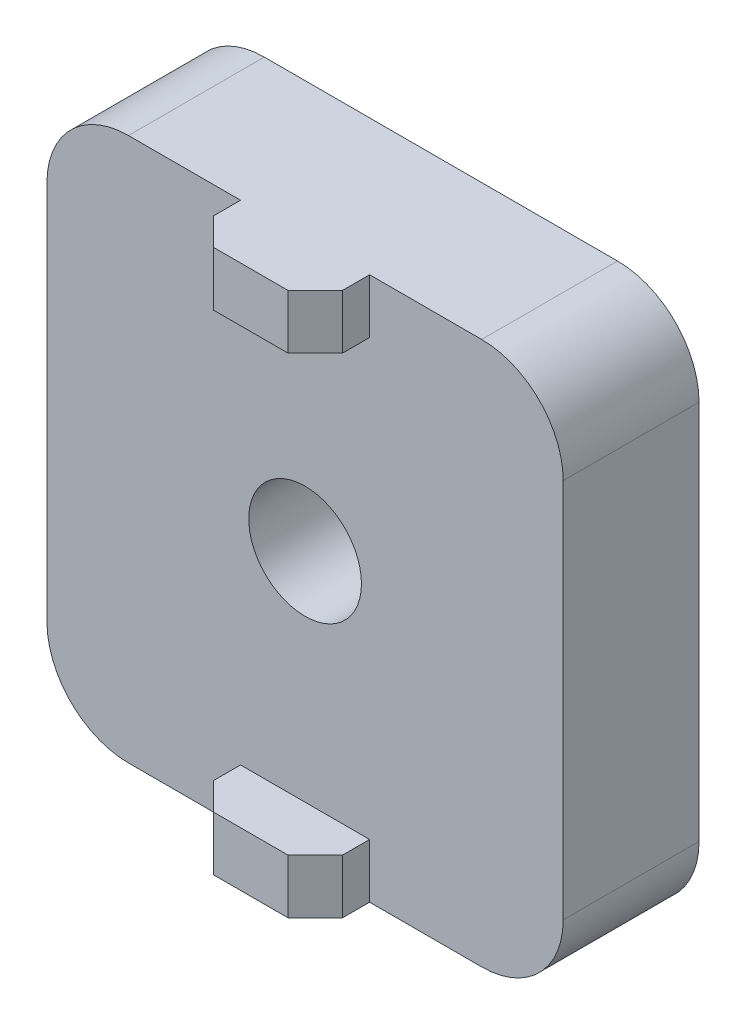
ISO-10303-21;
HEADER;
FILE_DESCRIPTION(('STEP AP214'),'2;1');
FILE_NAME('part.step','',(''),(''),'','','');
FILE_SCHEMA(('AUTOMOTIVE_DESIGN { 1 0 10303 214 1 1 1 1 }'));
ENDSEC;
DATA;
#1=APPLICATION_CONTEXT('core data for automotive mechanical design processes');
#2=APPLICATION_PROTOCOL_DEFINITION('international standard','automotive_design',2000,#1);
#3=PRODUCT_CONTEXT('',#1,'mechanical');
#4=PRODUCT('Part','Part','',(#3));
#5=PRODUCT_RELATED_PRODUCT_CATEGORY('part','',(#4));
#6=PRODUCT_DEFINITION_FORMATION('','',#4);
#7=PRODUCT_DEFINITION_CONTEXT('part definition',#1,'design');
#8=PRODUCT_DEFINITION('design','',#6,#7);
#9=PRODUCT_DEFINITION_SHAPE('','',#8);
#10=(LENGTH_UNIT() NAMED_UNIT(*) SI_UNIT(.MILLI.,.METRE.));
#11=(NAMED_UNIT(*) PLANE_ANGLE_UNIT() SI_UNIT($,.RADIAN.));
#12=(NAMED_UNIT(*) SI_UNIT($,.STERADIAN.) SOLID_ANGLE_UNIT());
#13=UNCERTAINTY_MEASURE_WITH_UNIT(LENGTH_MEASURE(1.E-05),#10,'distance_accuracy_value','');
#14=(GEOMETRIC_REPRESENTATION_CONTEXT(3) GLOBAL_UNCERTAINTY_ASSIGNED_CONTEXT((#13)) GLOBAL_UNIT_ASSIGNED_CONTEXT((#10,
#11,#12)) REPRESENTATION_CONTEXT('',''));
#15=CARTESIAN_POINT('',(0.,0.,0.));
#16=DIRECTION('',(0.,0.,1.));
#17=DIRECTION('',(1.,0.,0.));
#18=AXIS2_PLACEMENT_3D('',#15,#16,#17);
#19=CARTESIAN_POINT('',(0.,0.,5.));
#20=DIRECTION('',(0.,0.,-1.));
#21=DIRECTION('',(-1.,0.,0.));
#22=AXIS2_PLACEMENT_3D('',#19,#20,#21);
#23=PLANE('',#22);
#24=CARTESIAN_POINT('',(0.,0.,5.));
#25=DIRECTION('',(0.,0.,1.));
#26=DIRECTION('',(1.,0.,0.));
#27=AXIS2_PLACEMENT_3D('',#24,#25,#26);
#28=CIRCLE('',#27,4.15);
#29=CARTESIAN_POINT('',(4.15,0.,5.));
#30=VERTEX_POINT('',#29);
#31=EDGE_CURVE('E267',#30,#30,#28,.T.);
#32=ORIENTED_EDGE('',*,*,#31,.F.);
#33=EDGE_LOOP('',(#32));
#34=FACE_BOUND('',#33,.T.);
#35=DIRECTION('',(0.,-1.,0.));
#36=VECTOR('',#35,1.);
#37=CARTESIAN_POINT('',(-4.75,-16.,5.));
#38=LINE('',#37,#36);
#39=CARTESIAN_POINT('',(-4.75,-16.,5.));
#40=VERTEX_POINT('',#39);
#41=CARTESIAN_POINT('',(-4.75,-20.,5.));
#42=VERTEX_POINT('',#41);
#43=EDGE_CURVE('E214',#40,#42,#38,.T.);
#44=ORIENTED_EDGE('',*,*,#43,.F.);
#45=DIRECTION('',(-1.,0.,0.));
#46=VECTOR('',#45,1.);
#47=CARTESIAN_POINT('',(-4.75,-16.,5.));
#48=LINE('',#47,#46);
#49=CARTESIAN_POINT('',(4.75,-16.,5.));
#50=VERTEX_POINT('',#49);
#51=EDGE_CURVE('E211',#50,#40,#48,.T.);
#52=ORIENTED_EDGE('',*,*,#51,.F.);
#53=DIRECTION('',(0.,1.,0.));
#54=VECTOR('',#53,1.);
#55=CARTESIAN_POINT('',(4.75,-16.,5.));
#56=LINE('',#55,#54);
#57=CARTESIAN_POINT('',(4.75,-20.,5.));
#58=VERTEX_POINT('',#57);
#59=EDGE_CURVE('E186',#58,#50,#56,.T.);
#60=ORIENTED_EDGE('',*,*,#59,.F.);
#61=DIRECTION('',(1.,0.,0.));
#62=VECTOR('',#61,1.);
#63=CARTESIAN_POINT('',(-19.,-20.,5.));
#64=LINE('',#63,#62);
#65=CARTESIAN_POINT('',(13.,-20.,5.));
#66=VERTEX_POINT('',#65);
#67=EDGE_CURVE('E196',#58,#66,#64,.T.);
#68=ORIENTED_EDGE('',*,*,#67,.T.);
#69=CARTESIAN_POINT('',(13.,-14.,5.));
#70=DIRECTION('',(0.,0.,-1.));
#71=DIRECTION('',(-1.,0.,0.));
#72=AXIS2_PLACEMENT_3D('',#69,#70,#71);
#73=CIRCLE('',#72,6.);
#74=CARTESIAN_POINT('',(19.,-14.,5.));
#75=VERTEX_POINT('',#74);
#76=EDGE_CURVE('E332',#66,#75,#73,.F.);
#77=ORIENTED_EDGE('',*,*,#76,.T.);
#78=DIRECTION('',(0.,1.,0.));
#79=VECTOR('',#78,1.);
#80=CARTESIAN_POINT('',(19.,-20.,5.));
#81=LINE('',#80,#79);
#82=CARTESIAN_POINT('',(19.,14.,5.));
#83=VERTEX_POINT('',#82);
#84=EDGE_CURVE('E274',#75,#83,#81,.T.);
#85=ORIENTED_EDGE('',*,*,#84,.T.);
#86=CARTESIAN_POINT('',(13.,14.,5.));
#87=DIRECTION('',(0.,0.,-1.));
#88=DIRECTION('',(-1.,0.,0.));
#89=AXIS2_PLACEMENT_3D('',#86,#87,#88);
#90=CIRCLE('',#89,6.);
#91=CARTESIAN_POINT('',(13.,20.,5.));
#92=VERTEX_POINT('',#91);
#93=EDGE_CURVE('E329',#83,#92,#90,.F.);
#94=ORIENTED_EDGE('',*,*,#93,.T.);
#95=DIRECTION('',(-1.,0.,0.));
#96=VECTOR('',#95,1.);
#97=CARTESIAN_POINT('',(-19.,20.,5.));
#98=LINE('',#97,#96);
#99=CARTESIAN_POINT('',(4.74999999999999,20.,5.));
#100=VERTEX_POINT('',#99);
#101=EDGE_CURVE('E280',#92,#100,#98,.T.);
#102=ORIENTED_EDGE('',*,*,#101,.T.);
#103=DIRECTION('',(0.,1.,0.));
#104=VECTOR('',#103,1.);
#105=CARTESIAN_POINT('',(4.75,16.,5.));
#106=LINE('',#105,#104);
#107=CARTESIAN_POINT('',(4.75,16.,5.));
#108=VERTEX_POINT('',#107);
#109=EDGE_CURVE('E234',#108,#100,#106,.T.);
#110=ORIENTED_EDGE('',*,*,#109,.F.);
#111=DIRECTION('',(1.,0.,0.));
#112=VECTOR('',#111,1.);
#113=CARTESIAN_POINT('',(-4.75,16.,5.));
#114=LINE('',#113,#112);
#115=CARTESIAN_POINT('',(-4.75,16.,5.));
#116=VERTEX_POINT('',#115);
#117=EDGE_CURVE('E240',#116,#108,#114,.T.);
#118=ORIENTED_EDGE('',*,*,#117,.F.);
#119=DIRECTION('',(0.,-1.,0.));
#120=VECTOR('',#119,1.);
#121=CARTESIAN_POINT('',(-4.75,16.,5.));
#122=LINE('',#121,#120);
#123=CARTESIAN_POINT('',(-4.75,20.,5.));
#124=VERTEX_POINT('',#123);
#125=EDGE_CURVE('E248',#124,#116,#122,.T.);
#126=ORIENTED_EDGE('',*,*,#125,.F.);
#127=CARTESIAN_POINT('',(-13.,20.,5.));
#128=VERTEX_POINT('',#127);
#129=EDGE_CURVE('E278',#124,#128,#98,.T.);
#130=ORIENTED_EDGE('',*,*,#129,.T.);
#131=CARTESIAN_POINT('',(-13.,14.,5.));
#132=DIRECTION('',(0.,0.,-1.));
#133=DIRECTION('',(-1.,0.,0.));
#134=AXIS2_PLACEMENT_3D('',#131,#132,#133);
#135=CIRCLE('',#134,6.);
#136=CARTESIAN_POINT('',(-19.,14.,5.));
#137=VERTEX_POINT('',#136);
#138=EDGE_CURVE('E337',#128,#137,#135,.F.);
#139=ORIENTED_EDGE('',*,*,#138,.T.);
#140=DIRECTION('',(0.,-1.,0.));
#141=VECTOR('',#140,1.);
#142=CARTESIAN_POINT('',(-19.,-20.,5.));
#143=LINE('',#142,#141);
#144=CARTESIAN_POINT('',(-19.,-14.,5.));
#145=VERTEX_POINT('',#144);
#146=EDGE_CURVE('E206',#137,#145,#143,.T.);
#147=ORIENTED_EDGE('',*,*,#146,.T.);
#148=CARTESIAN_POINT('',(-13.,-14.,5.));
#149=DIRECTION('',(0.,0.,-1.));
#150=DIRECTION('',(-1.,0.,0.));
#151=AXIS2_PLACEMENT_3D('',#148,#149,#150);
#152=CIRCLE('',#151,6.);
#153=CARTESIAN_POINT('',(-13.,-20.,5.));
#154=VERTEX_POINT('',#153);
#155=EDGE_CURVE('E334',#145,#154,#152,.F.);
#156=ORIENTED_EDGE('',*,*,#155,.T.);
#157=EDGE_CURVE('E205',#154,#42,#64,.T.);
#158=ORIENTED_EDGE('',*,*,#157,.T.);
#159=EDGE_LOOP('',(#44,#52,#60,#68,#77,#85,#94,#102,#110,#118,#126,#130,#139,#147,#156,#158));
#160=FACE_BOUND('',#159,.T.);
#161=ADVANCED_FACE('F43',(#34,#160),#23,.F.);
#162=CARTESIAN_POINT('',(0.,0.,-5.));
#163=DIRECTION('',(0.,0.,-1.));
#164=DIRECTION('',(-1.,0.,0.));
#165=AXIS2_PLACEMENT_3D('',#162,#163,#164);
#166=PLANE('',#165);
#167=DIRECTION('',(0.,-1.,0.));
#168=VECTOR('',#167,1.);
#169=CARTESIAN_POINT('',(-19.,-20.,-5.));
#170=LINE('',#169,#168);
#171=CARTESIAN_POINT('',(-19.,14.,-5.));
#172=VERTEX_POINT('',#171);
#173=CARTESIAN_POINT('',(-19.,-14.,-5.));
#174=VERTEX_POINT('',#173);
#175=EDGE_CURVE('E297',#172,#174,#170,.T.);
#176=ORIENTED_EDGE('',*,*,#175,.F.);
#177=CARTESIAN_POINT('',(-13.,14.,-5.));
#178=DIRECTION('',(0.,0.,-1.));
#179=DIRECTION('',(-1.,0.,0.));
#180=AXIS2_PLACEMENT_3D('',#177,#178,#179);
#181=CIRCLE('',#180,6.);
#182=CARTESIAN_POINT('',(-13.,20.,-5.));
#183=VERTEX_POINT('',#182);
#184=EDGE_CURVE('E318',#172,#183,#181,.T.);
#185=ORIENTED_EDGE('',*,*,#184,.T.);
#186=DIRECTION('',(-1.,0.,0.));
#187=VECTOR('',#186,1.);
#188=CARTESIAN_POINT('',(-19.,20.,-5.));
#189=LINE('',#188,#187);
#190=CARTESIAN_POINT('',(13.,20.,-5.));
#191=VERTEX_POINT('',#190);
#192=EDGE_CURVE('E293',#191,#183,#189,.T.);
#193=ORIENTED_EDGE('',*,*,#192,.F.);
#194=CARTESIAN_POINT('',(13.,14.,-5.));
#195=DIRECTION('',(0.,0.,-1.));
#196=DIRECTION('',(-1.,0.,0.));
#197=AXIS2_PLACEMENT_3D('',#194,#195,#196);
#198=CIRCLE('',#197,6.);
#199=CARTESIAN_POINT('',(19.,14.,-5.));
#200=VERTEX_POINT('',#199);
#201=EDGE_CURVE('E309',#191,#200,#198,.T.);
#202=ORIENTED_EDGE('',*,*,#201,.T.);
#203=DIRECTION('',(0.,1.,0.));
#204=VECTOR('',#203,1.);
#205=CARTESIAN_POINT('',(19.,-20.,-5.));
#206=LINE('',#205,#204);
#207=CARTESIAN_POINT('',(19.,-14.,-5.));
#208=VERTEX_POINT('',#207);
#209=EDGE_CURVE('E270',#208,#200,#206,.T.);
#210=ORIENTED_EDGE('',*,*,#209,.F.);
#211=CARTESIAN_POINT('',(13.,-14.,-5.));
#212=DIRECTION('',(0.,0.,-1.));
#213=DIRECTION('',(-1.,0.,0.));
#214=AXIS2_PLACEMENT_3D('',#211,#212,#213);
#215=CIRCLE('',#214,6.);
#216=CARTESIAN_POINT('',(13.,-20.,-5.));
#217=VERTEX_POINT('',#216);
#218=EDGE_CURVE('E312',#208,#217,#215,.T.);
#219=ORIENTED_EDGE('',*,*,#218,.T.);
#220=DIRECTION('',(1.,0.,0.));
#221=VECTOR('',#220,1.);
#222=CARTESIAN_POINT('',(-19.,-20.,-5.));
#223=LINE('',#222,#221);
#224=CARTESIAN_POINT('',(-13.,-20.,-5.));
#225=VERTEX_POINT('',#224);
#226=EDGE_CURVE('E279',#225,#217,#223,.T.);
#227=ORIENTED_EDGE('',*,*,#226,.F.);
#228=CARTESIAN_POINT('',(-13.,-14.,-5.));
#229=DIRECTION('',(0.,0.,-1.));
#230=DIRECTION('',(-1.,0.,0.));
#231=AXIS2_PLACEMENT_3D('',#228,#229,#230);
#232=CIRCLE('',#231,6.);
#233=EDGE_CURVE('E315',#225,#174,#232,.T.);
#234=ORIENTED_EDGE('',*,*,#233,.T.);
#235=EDGE_LOOP('',(#176,#185,#193,#202,#210,#219,#227,#234));
#236=FACE_BOUND('',#235,.T.);
#237=CARTESIAN_POINT('',(0.,0.,-5.));
#238=DIRECTION('',(0.,0.,1.));
#239=DIRECTION('',(1.,0.,0.));
#240=AXIS2_PLACEMENT_3D('',#237,#238,#239);
#241=CIRCLE('',#240,4.15);
#242=CARTESIAN_POINT('',(4.15,0.,-5.));
#243=VERTEX_POINT('',#242);
#244=EDGE_CURVE('E266',#243,#243,#241,.T.);
#245=ORIENTED_EDGE('',*,*,#244,.T.);
#246=EDGE_LOOP('',(#245));
#247=FACE_BOUND('',#246,.T.);
#248=ADVANCED_FACE('F432',(#236,#247),#166,.T.);
#249=CARTESIAN_POINT('',(19.,-20.,5.));
#250=DIRECTION('',(-1.,0.,0.));
#251=DIRECTION('',(0.,0.,1.));
#252=AXIS2_PLACEMENT_3D('',#249,#250,#251);
#253=PLANE('',#252);
#254=ORIENTED_EDGE('',*,*,#84,.F.);
#255=DIRECTION('',(0.,0.,-1.));
#256=VECTOR('',#255,1.);
#257=CARTESIAN_POINT('',(19.,-14.,5.));
#258=LINE('',#257,#256);
#259=EDGE_CURVE('E349',#75,#208,#258,.T.);
#260=ORIENTED_EDGE('',*,*,#259,.T.);
#261=ORIENTED_EDGE('',*,*,#209,.T.);
#262=DIRECTION('',(0.,0.,-1.));
#263=VECTOR('',#262,1.);
#264=CARTESIAN_POINT('',(19.,14.,5.));
#265=LINE('',#264,#263);
#266=EDGE_CURVE('E346',#200,#83,#265,.F.);
#267=ORIENTED_EDGE('',*,*,#266,.T.);
#268=EDGE_LOOP('',(#254,#260,#261,#267));
#269=FACE_BOUND('',#268,.T.);
#270=ADVANCED_FACE('F472',(#269),#253,.F.);
#271=CARTESIAN_POINT('',(-19.,20.,5.));
#272=DIRECTION('',(0.,-1.,0.));
#273=DIRECTION('',(0.,0.,-1.));
#274=AXIS2_PLACEMENT_3D('',#271,#272,#273);
#275=PLANE('',#274);
#276=DIRECTION('',(-1.,0.,0.));
#277=VECTOR('',#276,1.);
#278=CARTESIAN_POINT('',(-4.75,20.,9.));
#279=LINE('',#278,#277);
#280=CARTESIAN_POINT('',(2.74999999999999,20.,9.));
#281=VERTEX_POINT('',#280);
#282=CARTESIAN_POINT('',(-2.75,20.,9.));
#283=VERTEX_POINT('',#282);
#284=EDGE_CURVE('E235',#281,#283,#279,.T.);
#285=ORIENTED_EDGE('',*,*,#284,.F.);
#286=DIRECTION('',(-0.707106781186546,0.,0.707106781186549));
#287=VECTOR('',#286,1.);
#288=CARTESIAN_POINT('',(2.74999999999999,20.,9.));
#289=LINE('',#288,#287);
#290=CARTESIAN_POINT('',(4.75,20.,6.99999999999999));
#291=VERTEX_POINT('',#290);
#292=EDGE_CURVE('E389',#281,#291,#289,.F.);
#293=ORIENTED_EDGE('',*,*,#292,.T.);
#294=DIRECTION('',(0.,0.,-1.));
#295=VECTOR('',#294,1.);
#296=CARTESIAN_POINT('',(4.75,20.,9.));
#297=LINE('',#296,#295);
#298=EDGE_CURVE('E263',#291,#100,#297,.T.);
#299=ORIENTED_EDGE('',*,*,#298,.T.);
#300=ORIENTED_EDGE('',*,*,#101,.F.);
#301=DIRECTION('',(0.,0.,-1.));
#302=VECTOR('',#301,1.);
#303=CARTESIAN_POINT('',(13.,20.,5.));
#304=LINE('',#303,#302);
#305=EDGE_CURVE('E321',#92,#191,#304,.T.);
#306=ORIENTED_EDGE('',*,*,#305,.T.);
#307=ORIENTED_EDGE('',*,*,#192,.T.);
#308=DIRECTION('',(0.,0.,-1.));
#309=VECTOR('',#308,1.);
#310=CARTESIAN_POINT('',(-13.,20.,5.));
#311=LINE('',#310,#309);
#312=EDGE_CURVE('E325',#183,#128,#311,.F.);
#313=ORIENTED_EDGE('',*,*,#312,.T.);
#314=ORIENTED_EDGE('',*,*,#129,.F.);
#315=DIRECTION('',(0.,0.,-1.));
#316=VECTOR('',#315,1.);
#317=CARTESIAN_POINT('',(-4.75,20.,9.));
#318=LINE('',#317,#316);
#319=CARTESIAN_POINT('',(-4.75,20.,6.99999999999999));
#320=VERTEX_POINT('',#319);
#321=EDGE_CURVE('E260',#320,#124,#318,.T.);
#322=ORIENTED_EDGE('',*,*,#321,.F.);
#323=DIRECTION('',(-0.707106781186546,0.,-0.707106781186549));
#324=VECTOR('',#323,1.);
#325=CARTESIAN_POINT('',(-2.75,20.,9.));
#326=LINE('',#325,#324);
#327=EDGE_CURVE('E386',#320,#283,#326,.F.);
#328=ORIENTED_EDGE('',*,*,#327,.T.);
#329=EDGE_LOOP('',(#285,#293,#299,#300,#306,#307,#313,#314,#322,#328));
#330=FACE_BOUND('',#329,.T.);
#331=ADVANCED_FACE('F406',(#330),#275,.F.);
#332=CARTESIAN_POINT('',(-19.,-20.,5.));
#333=DIRECTION('',(1.,0.,0.));
#334=DIRECTION('',(0.,0.,-1.));
#335=AXIS2_PLACEMENT_3D('',#332,#333,#334);
#336=PLANE('',#335);
#337=ORIENTED_EDGE('',*,*,#146,.F.);
#338=DIRECTION('',(0.,0.,-1.));
#339=VECTOR('',#338,1.);
#340=CARTESIAN_POINT('',(-19.,14.,5.));
#341=LINE('',#340,#339);
#342=EDGE_CURVE('E305',#137,#172,#341,.T.);
#343=ORIENTED_EDGE('',*,*,#342,.T.);
#344=ORIENTED_EDGE('',*,*,#175,.T.);
#345=DIRECTION('',(0.,0.,-1.));
#346=VECTOR('',#345,1.);
#347=CARTESIAN_POINT('',(-19.,-14.,5.));
#348=LINE('',#347,#346);
#349=EDGE_CURVE('E289',#174,#145,#348,.F.);
#350=ORIENTED_EDGE('',*,*,#349,.T.);
#351=EDGE_LOOP('',(#337,#343,#344,#350));
#352=FACE_BOUND('',#351,.T.);
#353=ADVANCED_FACE('F429',(#352),#336,.F.);
#354=CARTESIAN_POINT('',(-19.,-20.,5.));
#355=DIRECTION('',(0.,1.,0.));
#356=DIRECTION('',(0.,0.,1.));
#357=AXIS2_PLACEMENT_3D('',#354,#355,#356);
#358=PLANE('',#357);
#359=DIRECTION('',(1.,0.,0.));
#360=VECTOR('',#359,1.);
#361=CARTESIAN_POINT('',(-4.75,-20.,9.));
#362=LINE('',#361,#360);
#363=CARTESIAN_POINT('',(-2.75,-20.,9.));
#364=VERTEX_POINT('',#363);
#365=CARTESIAN_POINT('',(2.74999999999999,-20.,9.));
#366=VERTEX_POINT('',#365);
#367=EDGE_CURVE('E220',#364,#366,#362,.T.);
#368=ORIENTED_EDGE('',*,*,#367,.F.);
#369=DIRECTION('',(0.707106781186546,0.,0.707106781186549));
#370=VECTOR('',#369,1.);
#371=CARTESIAN_POINT('',(-2.75,-20.,9.));
#372=LINE('',#371,#370);
#373=CARTESIAN_POINT('',(-4.75,-20.,6.99999999999999));
#374=VERTEX_POINT('',#373);
#375=EDGE_CURVE('E364',#364,#374,#372,.F.);
#376=ORIENTED_EDGE('',*,*,#375,.T.);
#377=DIRECTION('',(0.,0.,-1.));
#378=VECTOR('',#377,1.);
#379=CARTESIAN_POINT('',(-4.75,-20.,9.));
#380=LINE('',#379,#378);
#381=EDGE_CURVE('E192',#374,#42,#380,.T.);
#382=ORIENTED_EDGE('',*,*,#381,.T.);
#383=ORIENTED_EDGE('',*,*,#157,.F.);
#384=DIRECTION('',(0.,0.,-1.));
#385=VECTOR('',#384,1.);
#386=CARTESIAN_POINT('',(-13.,-20.,5.));
#387=LINE('',#386,#385);
#388=EDGE_CURVE('E342',#154,#225,#387,.T.);
#389=ORIENTED_EDGE('',*,*,#388,.T.);
#390=ORIENTED_EDGE('',*,*,#226,.T.);
#391=DIRECTION('',(0.,0.,-1.));
#392=VECTOR('',#391,1.);
#393=CARTESIAN_POINT('',(13.,-20.,5.));
#394=LINE('',#393,#392);
#395=EDGE_CURVE('E201',#217,#66,#394,.F.);
#396=ORIENTED_EDGE('',*,*,#395,.T.);
#397=ORIENTED_EDGE('',*,*,#67,.F.);
#398=DIRECTION('',(0.,0.,-1.));
#399=VECTOR('',#398,1.);
#400=CARTESIAN_POINT('',(4.75,-20.,9.));
#401=LINE('',#400,#399);
#402=CARTESIAN_POINT('',(4.75,-20.,6.99999999999999));
#403=VERTEX_POINT('',#402);
#404=EDGE_CURVE('E181',#403,#58,#401,.T.);
#405=ORIENTED_EDGE('',*,*,#404,.F.);
#406=DIRECTION('',(0.707106781186546,0.,-0.707106781186549));
#407=VECTOR('',#406,1.);
#408=CARTESIAN_POINT('',(2.74999999999999,-20.,9.));
#409=LINE('',#408,#407);
#410=EDGE_CURVE('E361',#403,#366,#409,.F.);
#411=ORIENTED_EDGE('',*,*,#410,.T.);
#412=EDGE_LOOP('',(#368,#376,#382,#383,#389,#390,#396,#397,#405,#411));
#413=FACE_BOUND('',#412,.T.);
#414=ADVANCED_FACE('F198',(#413),#358,.F.);
#415=CARTESIAN_POINT('',(0.,0.,5.));
#416=DIRECTION('',(0.,0.,-1.));
#417=DIRECTION('',(-1.,0.,0.));
#418=AXIS2_PLACEMENT_3D('',#415,#416,#417);
#419=CYLINDRICAL_SURFACE('',#418,4.15);
#420=ORIENTED_EDGE('',*,*,#31,.T.);
#421=EDGE_LOOP('',(#420));
#422=FACE_BOUND('',#421,.T.);
#423=ORIENTED_EDGE('',*,*,#244,.F.);
#424=EDGE_LOOP('',(#423));
#425=FACE_BOUND('',#424,.T.);
#426=ADVANCED_FACE('F476',(#422,#425),#419,.F.);
#427=CARTESIAN_POINT('',(-13.,14.,5.));
#428=DIRECTION('',(0.,0.,-1.));
#429=DIRECTION('',(-1.,0.,0.));
#430=AXIS2_PLACEMENT_3D('',#427,#428,#429);
#431=CYLINDRICAL_SURFACE('',#430,6.);
#432=ORIENTED_EDGE('',*,*,#138,.F.);
#433=ORIENTED_EDGE('',*,*,#312,.F.);
#434=ORIENTED_EDGE('',*,*,#184,.F.);
#435=ORIENTED_EDGE('',*,*,#342,.F.);
#436=EDGE_LOOP('',(#432,#433,#434,#435));
#437=FACE_BOUND('',#436,.T.);
#438=ADVANCED_FACE('F426',(#437),#431,.T.);
#439=CARTESIAN_POINT('',(-13.,-14.,5.));
#440=DIRECTION('',(0.,0.,-1.));
#441=DIRECTION('',(-1.,0.,0.));
#442=AXIS2_PLACEMENT_3D('',#439,#440,#441);
#443=CYLINDRICAL_SURFACE('',#442,6.);
#444=ORIENTED_EDGE('',*,*,#155,.F.);
#445=ORIENTED_EDGE('',*,*,#349,.F.);
#446=ORIENTED_EDGE('',*,*,#233,.F.);
#447=ORIENTED_EDGE('',*,*,#388,.F.);
#448=EDGE_LOOP('',(#444,#445,#446,#447));
#449=FACE_BOUND('',#448,.T.);
#450=ADVANCED_FACE('F438',(#449),#443,.T.);
#451=CARTESIAN_POINT('',(13.,-14.,5.));
#452=DIRECTION('',(0.,0.,-1.));
#453=DIRECTION('',(-1.,0.,0.));
#454=AXIS2_PLACEMENT_3D('',#451,#452,#453);
#455=CYLINDRICAL_SURFACE('',#454,6.);
#456=ORIENTED_EDGE('',*,*,#76,.F.);
#457=ORIENTED_EDGE('',*,*,#395,.F.);
#458=ORIENTED_EDGE('',*,*,#218,.F.);
#459=ORIENTED_EDGE('',*,*,#259,.F.);
#460=EDGE_LOOP('',(#456,#457,#458,#459));
#461=FACE_BOUND('',#460,.T.);
#462=ADVANCED_FACE('F492',(#461),#455,.T.);
#463=CARTESIAN_POINT('',(13.,14.,5.));
#464=DIRECTION('',(0.,0.,-1.));
#465=DIRECTION('',(-1.,0.,0.));
#466=AXIS2_PLACEMENT_3D('',#463,#464,#465);
#467=CYLINDRICAL_SURFACE('',#466,6.);
#468=ORIENTED_EDGE('',*,*,#93,.F.);
#469=ORIENTED_EDGE('',*,*,#266,.F.);
#470=ORIENTED_EDGE('',*,*,#201,.F.);
#471=ORIENTED_EDGE('',*,*,#305,.F.);
#472=EDGE_LOOP('',(#468,#469,#470,#471));
#473=FACE_BOUND('',#472,.T.);
#474=ADVANCED_FACE('F495',(#473),#467,.T.);
#475=CARTESIAN_POINT('',(4.75,16.,9.));
#476=DIRECTION('',(-1.,0.,0.));
#477=DIRECTION('',(0.,0.,1.));
#478=AXIS2_PLACEMENT_3D('',#475,#476,#477);
#479=PLANE('',#478);
#480=ORIENTED_EDGE('',*,*,#298,.F.);
#481=DIRECTION('',(0.,-1.,0.));
#482=VECTOR('',#481,1.);
#483=CARTESIAN_POINT('',(4.75,16.,6.99999999999999));
#484=LINE('',#483,#482);
#485=CARTESIAN_POINT('',(4.75,16.,6.99999999999999));
#486=VERTEX_POINT('',#485);
#487=EDGE_CURVE('E67',#291,#486,#484,.T.);
#488=ORIENTED_EDGE('',*,*,#487,.T.);
#489=DIRECTION('',(0.,0.,-1.));
#490=VECTOR('',#489,1.);
#491=CARTESIAN_POINT('',(4.75,16.,9.));
#492=LINE('',#491,#490);
#493=EDGE_CURVE('E244',#486,#108,#492,.T.);
#494=ORIENTED_EDGE('',*,*,#493,.T.);
#495=ORIENTED_EDGE('',*,*,#109,.T.);
#496=EDGE_LOOP('',(#480,#488,#494,#495));
#497=FACE_BOUND('',#496,.T.);
#498=ADVANCED_FACE('F408',(#497),#479,.F.);
#499=CARTESIAN_POINT('',(-4.75,16.,9.));
#500=DIRECTION('',(1.,0.,0.));
#501=DIRECTION('',(0.,0.,-1.));
#502=AXIS2_PLACEMENT_3D('',#499,#500,#501);
#503=PLANE('',#502);
#504=DIRECTION('',(0.,0.,-1.));
#505=VECTOR('',#504,1.);
#506=CARTESIAN_POINT('',(-4.75,16.,9.));
#507=LINE('',#506,#505);
#508=CARTESIAN_POINT('',(-4.75,16.,6.99999999999999));
#509=VERTEX_POINT('',#508);
#510=EDGE_CURVE('E257',#509,#116,#507,.T.);
#511=ORIENTED_EDGE('',*,*,#510,.F.);
#512=DIRECTION('',(0.,1.,0.));
#513=VECTOR('',#512,1.);
#514=CARTESIAN_POINT('',(-4.75,16.,6.99999999999999));
#515=LINE('',#514,#513);
#516=EDGE_CURVE('E11',#509,#320,#515,.T.);
#517=ORIENTED_EDGE('',*,*,#516,.T.);
#518=ORIENTED_EDGE('',*,*,#321,.T.);
#519=ORIENTED_EDGE('',*,*,#125,.T.);
#520=EDGE_LOOP('',(#511,#517,#518,#519));
#521=FACE_BOUND('',#520,.T.);
#522=ADVANCED_FACE('F414',(#521),#503,.F.);
#523=CARTESIAN_POINT('',(-4.75,16.,9.));
#524=DIRECTION('',(0.,1.,0.));
#525=DIRECTION('',(0.,0.,1.));
#526=AXIS2_PLACEMENT_3D('',#523,#524,#525);
#527=PLANE('',#526);
#528=ORIENTED_EDGE('',*,*,#493,.F.);
#529=DIRECTION('',(0.707106781186546,0.,-0.707106781186549));
#530=VECTOR('',#529,1.);
#531=CARTESIAN_POINT('',(2.74999999999999,16.,9.));
#532=LINE('',#531,#530);
#533=CARTESIAN_POINT('',(2.74999999999999,16.,9.));
#534=VERTEX_POINT('',#533);
#535=EDGE_CURVE('E52',#486,#534,#532,.F.);
#536=ORIENTED_EDGE('',*,*,#535,.T.);
#537=DIRECTION('',(1.,0.,0.));
#538=VECTOR('',#537,1.);
#539=CARTESIAN_POINT('',(-4.75,16.,9.));
#540=LINE('',#539,#538);
#541=CARTESIAN_POINT('',(-2.75,16.,9.));
#542=VERTEX_POINT('',#541);
#543=EDGE_CURVE('E239',#542,#534,#540,.T.);
#544=ORIENTED_EDGE('',*,*,#543,.F.);
#545=DIRECTION('',(0.707106781186546,0.,0.707106781186549));
#546=VECTOR('',#545,1.);
#547=CARTESIAN_POINT('',(-2.75,16.,9.));
#548=LINE('',#547,#546);
#549=EDGE_CURVE('E59',#542,#509,#548,.F.);
#550=ORIENTED_EDGE('',*,*,#549,.T.);
#551=ORIENTED_EDGE('',*,*,#510,.T.);
#552=ORIENTED_EDGE('',*,*,#117,.T.);
#553=EDGE_LOOP('',(#528,#536,#544,#550,#551,#552));
#554=FACE_BOUND('',#553,.T.);
#555=ADVANCED_FACE('F397',(#554),#527,.F.);
#556=CARTESIAN_POINT('',(0.,0.,9.));
#557=DIRECTION('',(0.,0.,-1.));
#558=DIRECTION('',(-1.,0.,0.));
#559=AXIS2_PLACEMENT_3D('',#556,#557,#558);
#560=PLANE('',#559);
#561=ORIENTED_EDGE('',*,*,#543,.T.);
#562=DIRECTION('',(0.,1.,0.));
#563=VECTOR('',#562,1.);
#564=CARTESIAN_POINT('',(2.74999999999999,0.,9.));
#565=LINE('',#564,#563);
#566=EDGE_CURVE('E382',#534,#281,#565,.T.);
#567=ORIENTED_EDGE('',*,*,#566,.T.);
#568=ORIENTED_EDGE('',*,*,#284,.T.);
#569=DIRECTION('',(0.,-1.,0.));
#570=VECTOR('',#569,1.);
#571=CARTESIAN_POINT('',(-2.75,0.,9.));
#572=LINE('',#571,#570);
#573=EDGE_CURVE('E378',#283,#542,#572,.T.);
#574=ORIENTED_EDGE('',*,*,#573,.T.);
#575=EDGE_LOOP('',(#561,#567,#568,#574));
#576=FACE_BOUND('',#575,.T.);
#577=ADVANCED_FACE('F401',(#576),#560,.F.);
#578=CARTESIAN_POINT('',(-4.75,-16.,9.));
#579=DIRECTION('',(0.,-1.,0.));
#580=DIRECTION('',(0.,0.,-1.));
#581=AXIS2_PLACEMENT_3D('',#578,#579,#580);
#582=PLANE('',#581);
#583=DIRECTION('',(0.,0.,-1.));
#584=VECTOR('',#583,1.);
#585=CARTESIAN_POINT('',(-4.75,-16.,9.));
#586=LINE('',#585,#584);
#587=CARTESIAN_POINT('',(-4.75,-16.,6.99999999999999));
#588=VERTEX_POINT('',#587);
#589=EDGE_CURVE('E231',#588,#40,#586,.T.);
#590=ORIENTED_EDGE('',*,*,#589,.F.);
#591=DIRECTION('',(-0.707106781186546,0.,-0.707106781186549));
#592=VECTOR('',#591,1.);
#593=CARTESIAN_POINT('',(-2.75,-16.,9.));
#594=LINE('',#593,#592);
#595=CARTESIAN_POINT('',(-2.75,-16.,9.));
#596=VERTEX_POINT('',#595);
#597=EDGE_CURVE('E373',#588,#596,#594,.F.);
#598=ORIENTED_EDGE('',*,*,#597,.T.);
#599=DIRECTION('',(-1.,0.,0.));
#600=VECTOR('',#599,1.);
#601=CARTESIAN_POINT('',(-4.75,-16.,9.));
#602=LINE('',#601,#600);
#603=CARTESIAN_POINT('',(2.74999999999999,-16.,9.));
#604=VERTEX_POINT('',#603);
#605=EDGE_CURVE('E213',#604,#596,#602,.T.);
#606=ORIENTED_EDGE('',*,*,#605,.F.);
#607=DIRECTION('',(-0.707106781186546,0.,0.707106781186549));
#608=VECTOR('',#607,1.);
#609=CARTESIAN_POINT('',(2.74999999999999,-16.,9.));
#610=LINE('',#609,#608);
#611=CARTESIAN_POINT('',(4.75,-16.,6.99999999999999));
#612=VERTEX_POINT('',#611);
#613=EDGE_CURVE('E370',#604,#612,#610,.F.);
#614=ORIENTED_EDGE('',*,*,#613,.T.);
#615=DIRECTION('',(0.,0.,-1.));
#616=VECTOR('',#615,1.);
#617=CARTESIAN_POINT('',(4.75,-16.,9.));
#618=LINE('',#617,#616);
#619=EDGE_CURVE('E193',#612,#50,#618,.T.);
#620=ORIENTED_EDGE('',*,*,#619,.T.);
#621=ORIENTED_EDGE('',*,*,#51,.T.);
#622=EDGE_LOOP('',(#590,#598,#606,#614,#620,#621));
#623=FACE_BOUND('',#622,.T.);
#624=ADVANCED_FACE('F447',(#623),#582,.F.);
#625=CARTESIAN_POINT('',(-4.75,-16.,9.));
#626=DIRECTION('',(1.,0.,0.));
#627=DIRECTION('',(0.,0.,-1.));
#628=AXIS2_PLACEMENT_3D('',#625,#626,#627);
#629=PLANE('',#628);
#630=ORIENTED_EDGE('',*,*,#381,.F.);
#631=DIRECTION('',(0.,1.,0.));
#632=VECTOR('',#631,1.);
#633=CARTESIAN_POINT('',(-4.75,-16.,6.99999999999999));
#634=LINE('',#633,#632);
#635=EDGE_CURVE('E367',#374,#588,#634,.T.);
#636=ORIENTED_EDGE('',*,*,#635,.T.);
#637=ORIENTED_EDGE('',*,*,#589,.T.);
#638=ORIENTED_EDGE('',*,*,#43,.T.);
#639=EDGE_LOOP('',(#630,#636,#637,#638));
#640=FACE_BOUND('',#639,.T.);
#641=ADVANCED_FACE('F442',(#640),#629,.F.);
#642=CARTESIAN_POINT('',(4.75,-16.,9.));
#643=DIRECTION('',(-1.,0.,0.));
#644=DIRECTION('',(0.,0.,1.));
#645=AXIS2_PLACEMENT_3D('',#642,#643,#644);
#646=PLANE('',#645);
#647=ORIENTED_EDGE('',*,*,#619,.F.);
#648=DIRECTION('',(0.,-1.,0.));
#649=VECTOR('',#648,1.);
#650=CARTESIAN_POINT('',(4.75,-16.,6.99999999999999));
#651=LINE('',#650,#649);
#652=EDGE_CURVE('E188',#612,#403,#651,.T.);
#653=ORIENTED_EDGE('',*,*,#652,.T.);
#654=ORIENTED_EDGE('',*,*,#404,.T.);
#655=ORIENTED_EDGE('',*,*,#59,.T.);
#656=EDGE_LOOP('',(#647,#653,#654,#655));
#657=FACE_BOUND('',#656,.T.);
#658=ADVANCED_FACE('F184',(#657),#646,.F.);
#659=CARTESIAN_POINT('',(0.,0.,9.));
#660=DIRECTION('',(0.,0.,-1.));
#661=DIRECTION('',(-1.,0.,0.));
#662=AXIS2_PLACEMENT_3D('',#659,#660,#661);
#663=PLANE('',#662);
#664=ORIENTED_EDGE('',*,*,#605,.T.);
#665=DIRECTION('',(0.,-1.,0.));
#666=VECTOR('',#665,1.);
#667=CARTESIAN_POINT('',(-2.75,0.,9.));
#668=LINE('',#667,#666);
#669=EDGE_CURVE('E357',#596,#364,#668,.T.);
#670=ORIENTED_EDGE('',*,*,#669,.T.);
#671=ORIENTED_EDGE('',*,*,#367,.T.);
#672=DIRECTION('',(0.,1.,0.));
#673=VECTOR('',#672,1.);
#674=CARTESIAN_POINT('',(2.74999999999999,0.,9.));
#675=LINE('',#674,#673);
#676=EDGE_CURVE('E353',#366,#604,#675,.T.);
#677=ORIENTED_EDGE('',*,*,#676,.T.);
#678=EDGE_LOOP('',(#664,#670,#671,#677));
#679=FACE_BOUND('',#678,.T.);
#680=ADVANCED_FACE('F454',(#679),#663,.F.);
#681=CARTESIAN_POINT('',(-2.75,0.,9.));
#682=DIRECTION('',(0.707106781186549,0.,-0.707106781186546));
#683=DIRECTION('',(0.,-1.,0.));
#684=AXIS2_PLACEMENT_3D('',#681,#682,#683);
#685=PLANE('',#684);
#686=ORIENTED_EDGE('',*,*,#597,.F.);
#687=ORIENTED_EDGE('',*,*,#635,.F.);
#688=ORIENTED_EDGE('',*,*,#375,.F.);
#689=ORIENTED_EDGE('',*,*,#669,.F.);
#690=EDGE_LOOP('',(#686,#687,#688,#689));
#691=FACE_BOUND('',#690,.T.);
#692=ADVANCED_FACE('F451',(#691),#685,.F.);
#693=CARTESIAN_POINT('',(2.74999999999999,0.,9.));
#694=DIRECTION('',(-0.707106781186549,0.,-0.707106781186546));
#695=DIRECTION('',(0.,1.,0.));
#696=AXIS2_PLACEMENT_3D('',#693,#694,#695);
#697=PLANE('',#696);
#698=ORIENTED_EDGE('',*,*,#410,.F.);
#699=ORIENTED_EDGE('',*,*,#652,.F.);
#700=ORIENTED_EDGE('',*,*,#613,.F.);
#701=ORIENTED_EDGE('',*,*,#676,.F.);
#702=EDGE_LOOP('',(#698,#699,#700,#701));
#703=FACE_BOUND('',#702,.T.);
#704=ADVANCED_FACE('F460',(#703),#697,.F.);
#705=CARTESIAN_POINT('',(2.74999999999999,0.,9.));
#706=DIRECTION('',(-0.707106781186549,0.,-0.707106781186546));
#707=DIRECTION('',(0.,1.,0.));
#708=AXIS2_PLACEMENT_3D('',#705,#706,#707);
#709=PLANE('',#708);
#710=ORIENTED_EDGE('',*,*,#535,.F.);
#711=ORIENTED_EDGE('',*,*,#487,.F.);
#712=ORIENTED_EDGE('',*,*,#292,.F.);
#713=ORIENTED_EDGE('',*,*,#566,.F.);
#714=EDGE_LOOP('',(#710,#711,#712,#713));
#715=FACE_BOUND('',#714,.T.);
#716=ADVANCED_FACE('F404',(#715),#709,.F.);
#717=CARTESIAN_POINT('',(-2.75,0.,9.));
#718=DIRECTION('',(0.707106781186549,0.,-0.707106781186546));
#719=DIRECTION('',(0.,-1.,0.));
#720=AXIS2_PLACEMENT_3D('',#717,#718,#719);
#721=PLANE('',#720);
#722=ORIENTED_EDGE('',*,*,#327,.F.);
#723=ORIENTED_EDGE('',*,*,#516,.F.);
#724=ORIENTED_EDGE('',*,*,#549,.F.);
#725=ORIENTED_EDGE('',*,*,#573,.F.);
#726=EDGE_LOOP('',(#722,#723,#724,#725));
#727=FACE_BOUND('',#726,.T.);
#728=ADVANCED_FACE('F45',(#727),#721,.F.);
#729=CLOSED_SHELL('',(#161,#248,#270,#331,#353,#414,#426,#438,#450,#462,#474,#498,#522,#555,
#577,#624,#641,#658,#680,#692,#704,#716,#728));
#730=MANIFOLD_SOLID_BREP('B2',#729);
#731=ADVANCED_BREP_SHAPE_REPRESENTATION('',(#18,#730),#14);
#732=SHAPE_DEFINITION_REPRESENTATION(#9,#731);
ENDSEC;
END-ISO-10303-21;
